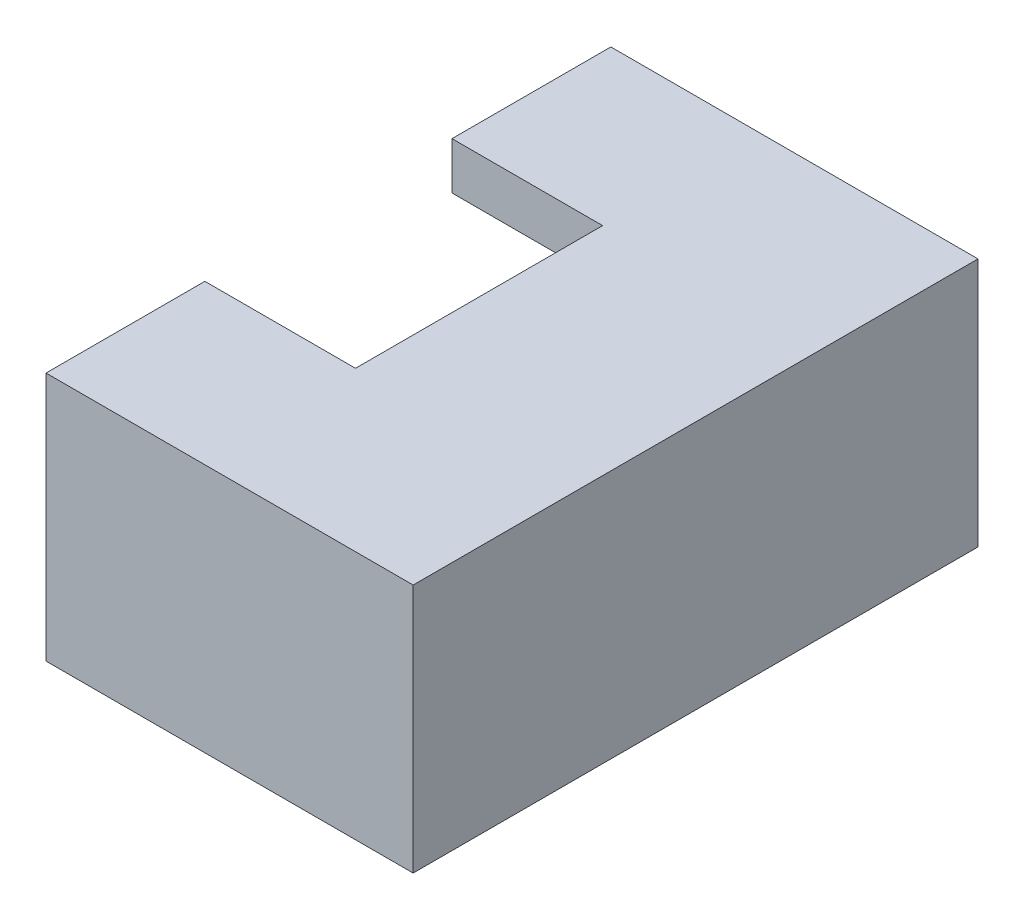
ISO-10303-21;
HEADER;
FILE_DESCRIPTION(('STEP AP214'),'2;1');
FILE_NAME('part.step','',(''),(''),'','','');
FILE_SCHEMA(('AUTOMOTIVE_DESIGN { 1 0 10303 214 1 1 1 1 }'));
ENDSEC;
DATA;
#1=APPLICATION_CONTEXT('core data for automotive mechanical design processes');
#2=APPLICATION_PROTOCOL_DEFINITION('international standard','automotive_design',2000,#1);
#3=PRODUCT_CONTEXT('',#1,'mechanical');
#4=PRODUCT('Part','Part','',(#3));
#5=PRODUCT_RELATED_PRODUCT_CATEGORY('part','',(#4));
#6=PRODUCT_DEFINITION_FORMATION('','',#4);
#7=PRODUCT_DEFINITION_CONTEXT('part definition',#1,'design');
#8=PRODUCT_DEFINITION('design','',#6,#7);
#9=PRODUCT_DEFINITION_SHAPE('','',#8);
#10=(LENGTH_UNIT() NAMED_UNIT(*) SI_UNIT(.MILLI.,.METRE.));
#11=(NAMED_UNIT(*) PLANE_ANGLE_UNIT() SI_UNIT($,.RADIAN.));
#12=(NAMED_UNIT(*) SI_UNIT($,.STERADIAN.) SOLID_ANGLE_UNIT());
#13=UNCERTAINTY_MEASURE_WITH_UNIT(LENGTH_MEASURE(1.E-05),#10,'distance_accuracy_value','');
#14=(GEOMETRIC_REPRESENTATION_CONTEXT(3) GLOBAL_UNCERTAINTY_ASSIGNED_CONTEXT((#13)) GLOBAL_UNIT_ASSIGNED_CONTEXT((#10,
#11,#12)) REPRESENTATION_CONTEXT('',''));
#15=CARTESIAN_POINT('',(0.,0.,0.));
#16=DIRECTION('',(0.,0.,1.));
#17=DIRECTION('',(1.,0.,0.));
#18=AXIS2_PLACEMENT_3D('',#15,#16,#17);
#19=CARTESIAN_POINT('',(3.55,3.4,-3.6));
#20=DIRECTION('',(0.,-1.,0.));
#21=DIRECTION('',(0.,0.,-1.));
#22=AXIS2_PLACEMENT_3D('',#19,#20,#21);
#23=PLANE('',#22);
#24=DIRECTION('',(1.,0.,0.));
#25=VECTOR('',#24,1.);
#26=CARTESIAN_POINT('',(3.55,3.4,-3.6));
#27=LINE('',#26,#25);
#28=CARTESIAN_POINT('',(7.55,3.4,-3.6));
#29=VERTEX_POINT('',#28);
#30=CARTESIAN_POINT('',(3.55,3.4,-3.6));
#31=VERTEX_POINT('',#30);
#32=EDGE_CURVE('P0_E64',#29,#31,#27,.F.);
#33=ORIENTED_EDGE('',*,*,#32,.T.);
#34=DIRECTION('',(0.,0.,1.));
#35=VECTOR('',#34,1.);
#36=CARTESIAN_POINT('',(3.55,3.4,0.));
#37=LINE('',#36,#35);
#38=CARTESIAN_POINT('',(3.55,3.4,-3.3));
#39=VERTEX_POINT('',#38);
#40=EDGE_CURVE('P0_E54',#39,#31,#37,.F.);
#41=ORIENTED_EDGE('',*,*,#40,.F.);
#42=DIRECTION('',(-1.,0.,0.));
#43=VECTOR('',#42,1.);
#44=CARTESIAN_POINT('',(3.55,3.4,-3.3));
#45=LINE('',#44,#43);
#46=CARTESIAN_POINT('',(7.55,3.4,-3.3));
#47=VERTEX_POINT('',#46);
#48=EDGE_CURVE('P0_E74',#39,#47,#45,.F.);
#49=ORIENTED_EDGE('',*,*,#48,.T.);
#50=DIRECTION('',(0.,0.,-1.));
#51=VECTOR('',#50,1.);
#52=CARTESIAN_POINT('',(7.55,3.4,-3.6));
#53=LINE('',#52,#51);
#54=EDGE_CURVE('P0_E19',#29,#47,#53,.F.);
#55=ORIENTED_EDGE('',*,*,#54,.F.);
#56=EDGE_LOOP('',(#33,#41,#49,#55));
#57=FACE_BOUND('',#56,.T.);
#58=ADVANCED_FACE('P0_F16',(#57),#23,.F.);
#59=CARTESIAN_POINT('',(3.55,3.4,-3.6));
#60=DIRECTION('',(0.,0.,1.));
#61=DIRECTION('',(1.,0.,0.));
#62=AXIS2_PLACEMENT_3D('',#59,#60,#61);
#63=PLANE('',#62);
#64=DIRECTION('',(1.,0.,0.));
#65=VECTOR('',#64,1.);
#66=CARTESIAN_POINT('',(3.55,3.1,-3.6));
#67=LINE('',#66,#65);
#68=CARTESIAN_POINT('',(7.55,3.1,-3.6));
#69=VERTEX_POINT('',#68);
#70=CARTESIAN_POINT('',(3.55,3.1,-3.6));
#71=VERTEX_POINT('',#70);
#72=EDGE_CURVE('P0_E72',#69,#71,#67,.F.);
#73=ORIENTED_EDGE('',*,*,#72,.T.);
#74=DIRECTION('',(0.,1.,0.));
#75=VECTOR('',#74,1.);
#76=CARTESIAN_POINT('',(3.55,0.,-3.6));
#77=LINE('',#76,#75);
#78=EDGE_CURVE('P0_E61',#31,#71,#77,.F.);
#79=ORIENTED_EDGE('',*,*,#78,.F.);
#80=ORIENTED_EDGE('',*,*,#32,.F.);
#81=DIRECTION('',(0.,1.,0.));
#82=VECTOR('',#81,1.);
#83=CARTESIAN_POINT('',(7.55,0.,-3.6));
#84=LINE('',#83,#82);
#85=EDGE_CURVE('P0_E78',#29,#69,#84,.F.);
#86=ORIENTED_EDGE('',*,*,#85,.T.);
#87=EDGE_LOOP('',(#73,#79,#80,#86));
#88=FACE_BOUND('',#87,.T.);
#89=ADVANCED_FACE('P0_F71',(#88),#63,.F.);
#90=CARTESIAN_POINT('',(3.55,0.,0.));
#91=DIRECTION('',(-1.,0.,0.));
#92=DIRECTION('',(0.,0.,1.));
#93=AXIS2_PLACEMENT_3D('',#90,#91,#92);
#94=PLANE('',#93);
#95=ORIENTED_EDGE('',*,*,#78,.T.);
#96=DIRECTION('',(0.,0.,1.));
#97=VECTOR('',#96,1.);
#98=CARTESIAN_POINT('',(3.55,3.1,-3.6));
#99=LINE('',#98,#97);
#100=CARTESIAN_POINT('',(3.55,3.1,-3.3));
#101=VERTEX_POINT('',#100);
#102=EDGE_CURVE('P0_E82',#71,#101,#99,.T.);
#103=ORIENTED_EDGE('',*,*,#102,.T.);
#104=DIRECTION('',(0.,1.,0.));
#105=VECTOR('',#104,1.);
#106=CARTESIAN_POINT('',(3.55,3.4,-3.3));
#107=LINE('',#106,#105);
#108=EDGE_CURVE('P0_E63',#101,#39,#107,.T.);
#109=ORIENTED_EDGE('',*,*,#108,.T.);
#110=ORIENTED_EDGE('',*,*,#40,.T.);
#111=EDGE_LOOP('',(#95,#103,#109,#110));
#112=FACE_BOUND('',#111,.T.);
#113=ADVANCED_FACE('P0_F58',(#112),#94,.T.);
#114=CARTESIAN_POINT('',(3.55,3.4,-3.3));
#115=DIRECTION('',(0.,0.,-1.));
#116=DIRECTION('',(-1.,0.,0.));
#117=AXIS2_PLACEMENT_3D('',#114,#115,#116);
#118=PLANE('',#117);
#119=ORIENTED_EDGE('',*,*,#48,.F.);
#120=ORIENTED_EDGE('',*,*,#108,.F.);
#121=DIRECTION('',(1.,0.,0.));
#122=VECTOR('',#121,1.);
#123=CARTESIAN_POINT('',(3.55,3.1,-3.3));
#124=LINE('',#123,#122);
#125=CARTESIAN_POINT('',(7.55,3.1,-3.3));
#126=VERTEX_POINT('',#125);
#127=EDGE_CURVE('P0_E25',#101,#126,#124,.T.);
#128=ORIENTED_EDGE('',*,*,#127,.T.);
#129=DIRECTION('',(0.,1.,0.));
#130=VECTOR('',#129,1.);
#131=CARTESIAN_POINT('',(7.55,0.,-3.3));
#132=LINE('',#131,#130);
#133=EDGE_CURVE('P0_E33',#126,#47,#132,.T.);
#134=ORIENTED_EDGE('',*,*,#133,.T.);
#135=EDGE_LOOP('',(#119,#120,#128,#134));
#136=FACE_BOUND('',#135,.T.);
#137=ADVANCED_FACE('P0_F87',(#136),#118,.F.);
#138=CARTESIAN_POINT('',(7.55,0.,0.));
#139=DIRECTION('',(-1.,0.,0.));
#140=DIRECTION('',(0.,0.,1.));
#141=AXIS2_PLACEMENT_3D('',#138,#139,#140);
#142=PLANE('',#141);
#143=DIRECTION('',(0.,0.,1.));
#144=VECTOR('',#143,1.);
#145=CARTESIAN_POINT('',(7.55,3.1,-3.6));
#146=LINE('',#145,#144);
#147=EDGE_CURVE('P0_E11',#126,#69,#146,.F.);
#148=ORIENTED_EDGE('',*,*,#147,.T.);
#149=ORIENTED_EDGE('',*,*,#85,.F.);
#150=ORIENTED_EDGE('',*,*,#54,.T.);
#151=ORIENTED_EDGE('',*,*,#133,.F.);
#152=EDGE_LOOP('',(#148,#149,#150,#151));
#153=FACE_BOUND('',#152,.T.);
#154=ADVANCED_FACE('P0_F90',(#153),#142,.F.);
#155=CARTESIAN_POINT('',(3.55,3.1,-3.6));
#156=DIRECTION('',(0.,1.,0.));
#157=DIRECTION('',(0.,0.,1.));
#158=AXIS2_PLACEMENT_3D('',#155,#156,#157);
#159=PLANE('',#158);
#160=ORIENTED_EDGE('',*,*,#127,.F.);
#161=ORIENTED_EDGE('',*,*,#102,.F.);
#162=ORIENTED_EDGE('',*,*,#72,.F.);
#163=ORIENTED_EDGE('',*,*,#147,.F.);
#164=EDGE_LOOP('',(#160,#161,#162,#163));
#165=FACE_BOUND('',#164,.T.);
#166=ADVANCED_FACE('P0_F89',(#165),#159,.F.);
#167=CLOSED_SHELL('',(#58,#89,#113,#137,#154,#166));
#168=MANIFOLD_SOLID_BREP('P0_B1',#167);
#169=CARTESIAN_POINT('',(3.55,3.4,-1.3));
#170=DIRECTION('',(0.,-1.,0.));
#171=DIRECTION('',(0.,0.,-1.));
#172=AXIS2_PLACEMENT_3D('',#169,#170,#171);
#173=PLANE('',#172);
#174=DIRECTION('',(1.,0.,0.));
#175=VECTOR('',#174,1.);
#176=CARTESIAN_POINT('',(3.55,3.4,-1.3));
#177=LINE('',#176,#175);
#178=CARTESIAN_POINT('',(7.55,3.4,-1.3));
#179=VERTEX_POINT('',#178);
#180=CARTESIAN_POINT('',(3.55,3.4,-1.3));
#181=VERTEX_POINT('',#180);
#182=EDGE_CURVE('P1_E64',#179,#181,#177,.F.);
#183=ORIENTED_EDGE('',*,*,#182,.T.);
#184=DIRECTION('',(0.,0.,1.));
#185=VECTOR('',#184,1.);
#186=CARTESIAN_POINT('',(3.55000000000001,3.4,0.));
#187=LINE('',#186,#185);
#188=CARTESIAN_POINT('',(3.55,3.4,-0.999999999999999));
#189=VERTEX_POINT('',#188);
#190=EDGE_CURVE('P1_E54',#189,#181,#187,.F.);
#191=ORIENTED_EDGE('',*,*,#190,.F.);
#192=DIRECTION('',(-1.,0.,0.));
#193=VECTOR('',#192,1.);
#194=CARTESIAN_POINT('',(3.55,3.4,-0.999999999999999));
#195=LINE('',#194,#193);
#196=CARTESIAN_POINT('',(7.55,3.4,-1.));
#197=VERTEX_POINT('',#196);
#198=EDGE_CURVE('P1_E74',#189,#197,#195,.F.);
#199=ORIENTED_EDGE('',*,*,#198,.T.);
#200=DIRECTION('',(0.,0.,-1.));
#201=VECTOR('',#200,1.);
#202=CARTESIAN_POINT('',(7.55,3.4,-1.3));
#203=LINE('',#202,#201);
#204=EDGE_CURVE('P1_E19',#179,#197,#203,.F.);
#205=ORIENTED_EDGE('',*,*,#204,.F.);
#206=EDGE_LOOP('',(#183,#191,#199,#205));
#207=FACE_BOUND('',#206,.T.);
#208=ADVANCED_FACE('P1_F16',(#207),#173,.F.);
#209=CARTESIAN_POINT('',(3.55,3.4,-1.3));
#210=DIRECTION('',(0.,0.,1.));
#211=DIRECTION('',(1.,0.,0.));
#212=AXIS2_PLACEMENT_3D('',#209,#210,#211);
#213=PLANE('',#212);
#214=DIRECTION('',(1.,0.,0.));
#215=VECTOR('',#214,1.);
#216=CARTESIAN_POINT('',(3.55,3.1,-1.3));
#217=LINE('',#216,#215);
#218=CARTESIAN_POINT('',(7.55,3.1,-1.3));
#219=VERTEX_POINT('',#218);
#220=CARTESIAN_POINT('',(3.55,3.1,-1.3));
#221=VERTEX_POINT('',#220);
#222=EDGE_CURVE('P1_E72',#219,#221,#217,.F.);
#223=ORIENTED_EDGE('',*,*,#222,.T.);
#224=DIRECTION('',(0.,1.,0.));
#225=VECTOR('',#224,1.);
#226=CARTESIAN_POINT('',(3.55,0.,-1.3));
#227=LINE('',#226,#225);
#228=EDGE_CURVE('P1_E61',#181,#221,#227,.F.);
#229=ORIENTED_EDGE('',*,*,#228,.F.);
#230=ORIENTED_EDGE('',*,*,#182,.F.);
#231=DIRECTION('',(0.,1.,0.));
#232=VECTOR('',#231,1.);
#233=CARTESIAN_POINT('',(7.55,0.,-1.3));
#234=LINE('',#233,#232);
#235=EDGE_CURVE('P1_E78',#179,#219,#234,.F.);
#236=ORIENTED_EDGE('',*,*,#235,.T.);
#237=EDGE_LOOP('',(#223,#229,#230,#236));
#238=FACE_BOUND('',#237,.T.);
#239=ADVANCED_FACE('P1_F71',(#238),#213,.F.);
#240=CARTESIAN_POINT('',(3.55000000000001,0.,0.));
#241=DIRECTION('',(-1.,0.,0.));
#242=DIRECTION('',(0.,0.,1.));
#243=AXIS2_PLACEMENT_3D('',#240,#241,#242);
#244=PLANE('',#243);
#245=ORIENTED_EDGE('',*,*,#228,.T.);
#246=DIRECTION('',(0.,0.,1.));
#247=VECTOR('',#246,1.);
#248=CARTESIAN_POINT('',(3.55,3.1,-1.3));
#249=LINE('',#248,#247);
#250=CARTESIAN_POINT('',(3.55,3.1,-0.999999999999999));
#251=VERTEX_POINT('',#250);
#252=EDGE_CURVE('P1_E82',#221,#251,#249,.T.);
#253=ORIENTED_EDGE('',*,*,#252,.T.);
#254=DIRECTION('',(0.,1.,0.));
#255=VECTOR('',#254,1.);
#256=CARTESIAN_POINT('',(3.55,3.4,-0.999999999999999));
#257=LINE('',#256,#255);
#258=EDGE_CURVE('P1_E63',#251,#189,#257,.T.);
#259=ORIENTED_EDGE('',*,*,#258,.T.);
#260=ORIENTED_EDGE('',*,*,#190,.T.);
#261=EDGE_LOOP('',(#245,#253,#259,#260));
#262=FACE_BOUND('',#261,.T.);
#263=ADVANCED_FACE('P1_F58',(#262),#244,.T.);
#264=CARTESIAN_POINT('',(3.55,3.4,-0.999999999999999));
#265=DIRECTION('',(0.,0.,-1.));
#266=DIRECTION('',(-1.,0.,0.));
#267=AXIS2_PLACEMENT_3D('',#264,#265,#266);
#268=PLANE('',#267);
#269=ORIENTED_EDGE('',*,*,#198,.F.);
#270=ORIENTED_EDGE('',*,*,#258,.F.);
#271=DIRECTION('',(1.,0.,0.));
#272=VECTOR('',#271,1.);
#273=CARTESIAN_POINT('',(3.55,3.1,-0.999999999999999));
#274=LINE('',#273,#272);
#275=CARTESIAN_POINT('',(7.55,3.1,-1.));
#276=VERTEX_POINT('',#275);
#277=EDGE_CURVE('P1_E25',#251,#276,#274,.T.);
#278=ORIENTED_EDGE('',*,*,#277,.T.);
#279=DIRECTION('',(0.,1.,0.));
#280=VECTOR('',#279,1.);
#281=CARTESIAN_POINT('',(7.55,0.,-1.));
#282=LINE('',#281,#280);
#283=EDGE_CURVE('P1_E33',#276,#197,#282,.T.);
#284=ORIENTED_EDGE('',*,*,#283,.T.);
#285=EDGE_LOOP('',(#269,#270,#278,#284));
#286=FACE_BOUND('',#285,.T.);
#287=ADVANCED_FACE('P1_F87',(#286),#268,.F.);
#288=CARTESIAN_POINT('',(7.55000000000001,0.,0.));
#289=DIRECTION('',(-1.,0.,0.));
#290=DIRECTION('',(0.,0.,1.));
#291=AXIS2_PLACEMENT_3D('',#288,#289,#290);
#292=PLANE('',#291);
#293=DIRECTION('',(0.,0.,1.));
#294=VECTOR('',#293,1.);
#295=CARTESIAN_POINT('',(7.55,3.1,-1.3));
#296=LINE('',#295,#294);
#297=EDGE_CURVE('P1_E11',#276,#219,#296,.F.);
#298=ORIENTED_EDGE('',*,*,#297,.T.);
#299=ORIENTED_EDGE('',*,*,#235,.F.);
#300=ORIENTED_EDGE('',*,*,#204,.T.);
#301=ORIENTED_EDGE('',*,*,#283,.F.);
#302=EDGE_LOOP('',(#298,#299,#300,#301));
#303=FACE_BOUND('',#302,.T.);
#304=ADVANCED_FACE('P1_F90',(#303),#292,.F.);
#305=CARTESIAN_POINT('',(3.55,3.1,-1.3));
#306=DIRECTION('',(0.,1.,0.));
#307=DIRECTION('',(0.,0.,1.));
#308=AXIS2_PLACEMENT_3D('',#305,#306,#307);
#309=PLANE('',#308);
#310=ORIENTED_EDGE('',*,*,#277,.F.);
#311=ORIENTED_EDGE('',*,*,#252,.F.);
#312=ORIENTED_EDGE('',*,*,#222,.F.);
#313=ORIENTED_EDGE('',*,*,#297,.F.);
#314=EDGE_LOOP('',(#310,#311,#312,#313));
#315=FACE_BOUND('',#314,.T.);
#316=ADVANCED_FACE('P1_F89',(#315),#309,.F.);
#317=CLOSED_SHELL('',(#208,#239,#263,#287,#304,#316));
#318=MANIFOLD_SOLID_BREP('P1_B1',#317);
#319=CARTESIAN_POINT('',(3.55,3.4,1.));
#320=DIRECTION('',(0.,-1.,0.));
#321=DIRECTION('',(0.,0.,-1.));
#322=AXIS2_PLACEMENT_3D('',#319,#320,#321);
#323=PLANE('',#322);
#324=DIRECTION('',(1.,0.,0.));
#325=VECTOR('',#324,1.);
#326=CARTESIAN_POINT('',(3.55,3.4,1.));
#327=LINE('',#326,#325);
#328=CARTESIAN_POINT('',(7.55,3.4,1.));
#329=VERTEX_POINT('',#328);
#330=CARTESIAN_POINT('',(3.55,3.4,1.));
#331=VERTEX_POINT('',#330);
#332=EDGE_CURVE('P2_E64',#329,#331,#327,.F.);
#333=ORIENTED_EDGE('',*,*,#332,.T.);
#334=DIRECTION('',(0.,0.,1.));
#335=VECTOR('',#334,1.);
#336=CARTESIAN_POINT('',(3.55,3.4,0.));
#337=LINE('',#336,#335);
#338=CARTESIAN_POINT('',(3.55,3.4,1.3));
#339=VERTEX_POINT('',#338);
#340=EDGE_CURVE('P2_E54',#339,#331,#337,.F.);
#341=ORIENTED_EDGE('',*,*,#340,.F.);
#342=DIRECTION('',(-1.,0.,0.));
#343=VECTOR('',#342,1.);
#344=CARTESIAN_POINT('',(3.55,3.4,1.3));
#345=LINE('',#344,#343);
#346=CARTESIAN_POINT('',(7.55,3.4,1.3));
#347=VERTEX_POINT('',#346);
#348=EDGE_CURVE('P2_E74',#339,#347,#345,.F.);
#349=ORIENTED_EDGE('',*,*,#348,.T.);
#350=DIRECTION('',(0.,0.,-1.));
#351=VECTOR('',#350,1.);
#352=CARTESIAN_POINT('',(7.55,3.4,1.));
#353=LINE('',#352,#351);
#354=EDGE_CURVE('P2_E19',#329,#347,#353,.F.);
#355=ORIENTED_EDGE('',*,*,#354,.F.);
#356=EDGE_LOOP('',(#333,#341,#349,#355));
#357=FACE_BOUND('',#356,.T.);
#358=ADVANCED_FACE('P2_F16',(#357),#323,.F.);
#359=CARTESIAN_POINT('',(3.55,3.4,1.));
#360=DIRECTION('',(0.,0.,1.));
#361=DIRECTION('',(1.,0.,0.));
#362=AXIS2_PLACEMENT_3D('',#359,#360,#361);
#363=PLANE('',#362);
#364=DIRECTION('',(1.,0.,0.));
#365=VECTOR('',#364,1.);
#366=CARTESIAN_POINT('',(3.55,3.1,0.999999999999999));
#367=LINE('',#366,#365);
#368=CARTESIAN_POINT('',(7.55,3.1,0.999999999999999));
#369=VERTEX_POINT('',#368);
#370=CARTESIAN_POINT('',(3.55,3.1,1.));
#371=VERTEX_POINT('',#370);
#372=EDGE_CURVE('P2_E72',#369,#371,#367,.F.);
#373=ORIENTED_EDGE('',*,*,#372,.T.);
#374=DIRECTION('',(0.,1.,0.));
#375=VECTOR('',#374,1.);
#376=CARTESIAN_POINT('',(3.55,0.,1.));
#377=LINE('',#376,#375);
#378=EDGE_CURVE('P2_E61',#331,#371,#377,.F.);
#379=ORIENTED_EDGE('',*,*,#378,.F.);
#380=ORIENTED_EDGE('',*,*,#332,.F.);
#381=DIRECTION('',(0.,1.,0.));
#382=VECTOR('',#381,1.);
#383=CARTESIAN_POINT('',(7.55,0.,0.999999999999999));
#384=LINE('',#383,#382);
#385=EDGE_CURVE('P2_E78',#329,#369,#384,.F.);
#386=ORIENTED_EDGE('',*,*,#385,.T.);
#387=EDGE_LOOP('',(#373,#379,#380,#386));
#388=FACE_BOUND('',#387,.T.);
#389=ADVANCED_FACE('P2_F71',(#388),#363,.F.);
#390=CARTESIAN_POINT('',(3.55,0.,0.));
#391=DIRECTION('',(-1.,0.,0.));
#392=DIRECTION('',(0.,0.,1.));
#393=AXIS2_PLACEMENT_3D('',#390,#391,#392);
#394=PLANE('',#393);
#395=ORIENTED_EDGE('',*,*,#378,.T.);
#396=DIRECTION('',(0.,0.,1.));
#397=VECTOR('',#396,1.);
#398=CARTESIAN_POINT('',(3.55,3.1,1.));
#399=LINE('',#398,#397);
#400=CARTESIAN_POINT('',(3.55,3.1,1.3));
#401=VERTEX_POINT('',#400);
#402=EDGE_CURVE('P2_E82',#371,#401,#399,.T.);
#403=ORIENTED_EDGE('',*,*,#402,.T.);
#404=DIRECTION('',(0.,1.,0.));
#405=VECTOR('',#404,1.);
#406=CARTESIAN_POINT('',(3.55,3.4,1.3));
#407=LINE('',#406,#405);
#408=EDGE_CURVE('P2_E63',#401,#339,#407,.T.);
#409=ORIENTED_EDGE('',*,*,#408,.T.);
#410=ORIENTED_EDGE('',*,*,#340,.T.);
#411=EDGE_LOOP('',(#395,#403,#409,#410));
#412=FACE_BOUND('',#411,.T.);
#413=ADVANCED_FACE('P2_F58',(#412),#394,.T.);
#414=CARTESIAN_POINT('',(3.55,3.4,1.3));
#415=DIRECTION('',(0.,0.,-1.));
#416=DIRECTION('',(-1.,0.,0.));
#417=AXIS2_PLACEMENT_3D('',#414,#415,#416);
#418=PLANE('',#417);
#419=ORIENTED_EDGE('',*,*,#348,.F.);
#420=ORIENTED_EDGE('',*,*,#408,.F.);
#421=DIRECTION('',(1.,0.,0.));
#422=VECTOR('',#421,1.);
#423=CARTESIAN_POINT('',(3.55,3.1,1.3));
#424=LINE('',#423,#422);
#425=CARTESIAN_POINT('',(7.55,3.1,1.3));
#426=VERTEX_POINT('',#425);
#427=EDGE_CURVE('P2_E25',#401,#426,#424,.T.);
#428=ORIENTED_EDGE('',*,*,#427,.T.);
#429=DIRECTION('',(0.,1.,0.));
#430=VECTOR('',#429,1.);
#431=CARTESIAN_POINT('',(7.55,0.,1.3));
#432=LINE('',#431,#430);
#433=EDGE_CURVE('P2_E33',#426,#347,#432,.T.);
#434=ORIENTED_EDGE('',*,*,#433,.T.);
#435=EDGE_LOOP('',(#419,#420,#428,#434));
#436=FACE_BOUND('',#435,.T.);
#437=ADVANCED_FACE('P2_F87',(#436),#418,.F.);
#438=CARTESIAN_POINT('',(7.55,0.,0.));
#439=DIRECTION('',(-1.,0.,0.));
#440=DIRECTION('',(0.,0.,1.));
#441=AXIS2_PLACEMENT_3D('',#438,#439,#440);
#442=PLANE('',#441);
#443=DIRECTION('',(0.,0.,1.));
#444=VECTOR('',#443,1.);
#445=CARTESIAN_POINT('',(7.55,3.1,1.));
#446=LINE('',#445,#444);
#447=EDGE_CURVE('P2_E11',#426,#369,#446,.F.);
#448=ORIENTED_EDGE('',*,*,#447,.T.);
#449=ORIENTED_EDGE('',*,*,#385,.F.);
#450=ORIENTED_EDGE('',*,*,#354,.T.);
#451=ORIENTED_EDGE('',*,*,#433,.F.);
#452=EDGE_LOOP('',(#448,#449,#450,#451));
#453=FACE_BOUND('',#452,.T.);
#454=ADVANCED_FACE('P2_F90',(#453),#442,.F.);
#455=CARTESIAN_POINT('',(3.55,3.1,1.));
#456=DIRECTION('',(0.,1.,0.));
#457=DIRECTION('',(0.,0.,1.));
#458=AXIS2_PLACEMENT_3D('',#455,#456,#457);
#459=PLANE('',#458);
#460=ORIENTED_EDGE('',*,*,#427,.F.);
#461=ORIENTED_EDGE('',*,*,#402,.F.);
#462=ORIENTED_EDGE('',*,*,#372,.F.);
#463=ORIENTED_EDGE('',*,*,#447,.F.);
#464=EDGE_LOOP('',(#460,#461,#462,#463));
#465=FACE_BOUND('',#464,.T.);
#466=ADVANCED_FACE('P2_F89',(#465),#459,.F.);
#467=CLOSED_SHELL('',(#358,#389,#413,#437,#454,#466));
#468=MANIFOLD_SOLID_BREP('P2_B1',#467);
#469=CARTESIAN_POINT('',(3.55000000000001,3.4,3.3));
#470=DIRECTION('',(0.,-1.,0.));
#471=DIRECTION('',(0.,0.,-1.));
#472=AXIS2_PLACEMENT_3D('',#469,#470,#471);
#473=PLANE('',#472);
#474=DIRECTION('',(1.,0.,0.));
#475=VECTOR('',#474,1.);
#476=CARTESIAN_POINT('',(3.55000000000001,3.4,3.3));
#477=LINE('',#476,#475);
#478=CARTESIAN_POINT('',(7.55,3.4,3.3));
#479=VERTEX_POINT('',#478);
#480=CARTESIAN_POINT('',(3.55000000000001,3.4,3.3));
#481=VERTEX_POINT('',#480);
#482=EDGE_CURVE('P3_E64',#479,#481,#477,.F.);
#483=ORIENTED_EDGE('',*,*,#482,.T.);
#484=DIRECTION('',(0.,0.,1.));
#485=VECTOR('',#484,1.);
#486=CARTESIAN_POINT('',(3.55000000000001,3.4,0.));
#487=LINE('',#486,#485);
#488=CARTESIAN_POINT('',(3.55000000000001,3.4,3.6));
#489=VERTEX_POINT('',#488);
#490=EDGE_CURVE('P3_E54',#489,#481,#487,.F.);
#491=ORIENTED_EDGE('',*,*,#490,.F.);
#492=DIRECTION('',(-1.,0.,0.));
#493=VECTOR('',#492,1.);
#494=CARTESIAN_POINT('',(3.55000000000001,3.4,3.6));
#495=LINE('',#494,#493);
#496=CARTESIAN_POINT('',(7.55,3.4,3.6));
#497=VERTEX_POINT('',#496);
#498=EDGE_CURVE('P3_E74',#489,#497,#495,.F.);
#499=ORIENTED_EDGE('',*,*,#498,.T.);
#500=DIRECTION('',(0.,0.,-1.));
#501=VECTOR('',#500,1.);
#502=CARTESIAN_POINT('',(7.55,3.4,3.3));
#503=LINE('',#502,#501);
#504=EDGE_CURVE('P3_E19',#479,#497,#503,.F.);
#505=ORIENTED_EDGE('',*,*,#504,.F.);
#506=EDGE_LOOP('',(#483,#491,#499,#505));
#507=FACE_BOUND('',#506,.T.);
#508=ADVANCED_FACE('P3_F16',(#507),#473,.F.);
#509=CARTESIAN_POINT('',(3.55000000000001,3.4,3.3));
#510=DIRECTION('',(0.,0.,1.));
#511=DIRECTION('',(1.,0.,0.));
#512=AXIS2_PLACEMENT_3D('',#509,#510,#511);
#513=PLANE('',#512);
#514=DIRECTION('',(1.,0.,0.));
#515=VECTOR('',#514,1.);
#516=CARTESIAN_POINT('',(3.55000000000001,3.1,3.3));
#517=LINE('',#516,#515);
#518=CARTESIAN_POINT('',(7.55,3.1,3.3));
#519=VERTEX_POINT('',#518);
#520=CARTESIAN_POINT('',(3.55000000000001,3.1,3.3));
#521=VERTEX_POINT('',#520);
#522=EDGE_CURVE('P3_E72',#519,#521,#517,.F.);
#523=ORIENTED_EDGE('',*,*,#522,.T.);
#524=DIRECTION('',(0.,1.,0.));
#525=VECTOR('',#524,1.);
#526=CARTESIAN_POINT('',(3.55000000000001,0.,3.3));
#527=LINE('',#526,#525);
#528=EDGE_CURVE('P3_E61',#481,#521,#527,.F.);
#529=ORIENTED_EDGE('',*,*,#528,.F.);
#530=ORIENTED_EDGE('',*,*,#482,.F.);
#531=DIRECTION('',(0.,1.,0.));
#532=VECTOR('',#531,1.);
#533=CARTESIAN_POINT('',(7.55,0.,3.3));
#534=LINE('',#533,#532);
#535=EDGE_CURVE('P3_E78',#479,#519,#534,.F.);
#536=ORIENTED_EDGE('',*,*,#535,.T.);
#537=EDGE_LOOP('',(#523,#529,#530,#536));
#538=FACE_BOUND('',#537,.T.);
#539=ADVANCED_FACE('P3_F71',(#538),#513,.F.);
#540=CARTESIAN_POINT('',(3.55000000000001,0.,0.));
#541=DIRECTION('',(-1.,0.,0.));
#542=DIRECTION('',(0.,0.,1.));
#543=AXIS2_PLACEMENT_3D('',#540,#541,#542);
#544=PLANE('',#543);
#545=ORIENTED_EDGE('',*,*,#528,.T.);
#546=DIRECTION('',(0.,0.,1.));
#547=VECTOR('',#546,1.);
#548=CARTESIAN_POINT('',(3.55000000000001,3.1,3.3));
#549=LINE('',#548,#547);
#550=CARTESIAN_POINT('',(3.55000000000001,3.1,3.6));
#551=VERTEX_POINT('',#550);
#552=EDGE_CURVE('P3_E82',#521,#551,#549,.T.);
#553=ORIENTED_EDGE('',*,*,#552,.T.);
#554=DIRECTION('',(0.,1.,0.));
#555=VECTOR('',#554,1.);
#556=CARTESIAN_POINT('',(3.55000000000001,3.4,3.6));
#557=LINE('',#556,#555);
#558=EDGE_CURVE('P3_E63',#551,#489,#557,.T.);
#559=ORIENTED_EDGE('',*,*,#558,.T.);
#560=ORIENTED_EDGE('',*,*,#490,.T.);
#561=EDGE_LOOP('',(#545,#553,#559,#560));
#562=FACE_BOUND('',#561,.T.);
#563=ADVANCED_FACE('P3_F58',(#562),#544,.T.);
#564=CARTESIAN_POINT('',(3.55000000000001,3.4,3.6));
#565=DIRECTION('',(0.,0.,-1.));
#566=DIRECTION('',(-1.,0.,0.));
#567=AXIS2_PLACEMENT_3D('',#564,#565,#566);
#568=PLANE('',#567);
#569=ORIENTED_EDGE('',*,*,#498,.F.);
#570=ORIENTED_EDGE('',*,*,#558,.F.);
#571=DIRECTION('',(1.,0.,0.));
#572=VECTOR('',#571,1.);
#573=CARTESIAN_POINT('',(3.55000000000001,3.1,3.6));
#574=LINE('',#573,#572);
#575=CARTESIAN_POINT('',(7.55,3.1,3.6));
#576=VERTEX_POINT('',#575);
#577=EDGE_CURVE('P3_E25',#551,#576,#574,.T.);
#578=ORIENTED_EDGE('',*,*,#577,.T.);
#579=DIRECTION('',(0.,1.,0.));
#580=VECTOR('',#579,1.);
#581=CARTESIAN_POINT('',(7.55,0.,3.6));
#582=LINE('',#581,#580);
#583=EDGE_CURVE('P3_E33',#576,#497,#582,.T.);
#584=ORIENTED_EDGE('',*,*,#583,.T.);
#585=EDGE_LOOP('',(#569,#570,#578,#584));
#586=FACE_BOUND('',#585,.T.);
#587=ADVANCED_FACE('P3_F87',(#586),#568,.F.);
#588=CARTESIAN_POINT('',(7.55,0.,0.));
#589=DIRECTION('',(-1.,0.,0.));
#590=DIRECTION('',(0.,0.,1.));
#591=AXIS2_PLACEMENT_3D('',#588,#589,#590);
#592=PLANE('',#591);
#593=DIRECTION('',(0.,0.,1.));
#594=VECTOR('',#593,1.);
#595=CARTESIAN_POINT('',(7.55,3.1,3.3));
#596=LINE('',#595,#594);
#597=EDGE_CURVE('P3_E11',#576,#519,#596,.F.);
#598=ORIENTED_EDGE('',*,*,#597,.T.);
#599=ORIENTED_EDGE('',*,*,#535,.F.);
#600=ORIENTED_EDGE('',*,*,#504,.T.);
#601=ORIENTED_EDGE('',*,*,#583,.F.);
#602=EDGE_LOOP('',(#598,#599,#600,#601));
#603=FACE_BOUND('',#602,.T.);
#604=ADVANCED_FACE('P3_F90',(#603),#592,.F.);
#605=CARTESIAN_POINT('',(3.55000000000001,3.1,3.3));
#606=DIRECTION('',(0.,1.,0.));
#607=DIRECTION('',(0.,0.,1.));
#608=AXIS2_PLACEMENT_3D('',#605,#606,#607);
#609=PLANE('',#608);
#610=ORIENTED_EDGE('',*,*,#577,.F.);
#611=ORIENTED_EDGE('',*,*,#552,.F.);
#612=ORIENTED_EDGE('',*,*,#522,.F.);
#613=ORIENTED_EDGE('',*,*,#597,.F.);
#614=EDGE_LOOP('',(#610,#611,#612,#613));
#615=FACE_BOUND('',#614,.T.);
#616=ADVANCED_FACE('P3_F89',(#615),#609,.F.);
#617=CLOSED_SHELL('',(#508,#539,#563,#587,#604,#616));
#618=MANIFOLD_SOLID_BREP('P3_B1',#617);
#619=CARTESIAN_POINT('',(7.55,5.55,-5.5));
#620=DIRECTION('',(0.,1.,0.));
#621=DIRECTION('',(0.,0.,1.));
#622=AXIS2_PLACEMENT_3D('',#619,#620,#621);
#623=PLANE('',#622);
#624=DIRECTION('',(-1.,0.,0.));
#625=VECTOR('',#624,1.);
#626=CARTESIAN_POINT('',(7.55,5.55,-5.5));
#627=LINE('',#626,#625);
#628=CARTESIAN_POINT('',(1.45,5.55,-5.5));
#629=VERTEX_POINT('',#628);
#630=CARTESIAN_POINT('',(7.55,5.55,-5.5));
#631=VERTEX_POINT('',#630);
#632=EDGE_CURVE('P4_E175',#629,#631,#627,.F.);
#633=ORIENTED_EDGE('',*,*,#632,.T.);
#634=DIRECTION('',(0.,0.,-1.));
#635=VECTOR('',#634,1.);
#636=CARTESIAN_POINT('',(7.55,5.55,0.));
#637=LINE('',#636,#635);
#638=CARTESIAN_POINT('',(7.55,5.55,-5.));
#639=VERTEX_POINT('',#638);
#640=EDGE_CURVE('P4_E150',#631,#639,#637,.F.);
#641=ORIENTED_EDGE('',*,*,#640,.T.);
#642=DIRECTION('',(1.,0.,0.));
#643=VECTOR('',#642,1.);
#644=CARTESIAN_POINT('',(7.55,5.55,-5.));
#645=LINE('',#644,#643);
#646=CARTESIAN_POINT('',(1.45,5.55,-5.));
#647=VERTEX_POINT('',#646);
#648=EDGE_CURVE('P4_E160',#639,#647,#645,.F.);
#649=ORIENTED_EDGE('',*,*,#648,.T.);
#650=DIRECTION('',(0.,0.,1.));
#651=VECTOR('',#650,1.);
#652=CARTESIAN_POINT('',(1.45,5.55,-5.5));
#653=LINE('',#652,#651);
#654=EDGE_CURVE('P4_E19',#629,#647,#653,.T.);
#655=ORIENTED_EDGE('',*,*,#654,.F.);
#656=EDGE_LOOP('',(#633,#641,#649,#655));
#657=FACE_BOUND('',#656,.T.);
#658=ADVANCED_FACE('P4_F16',(#657),#623,.F.);
#659=CARTESIAN_POINT('',(7.55,5.55,5.5));
#660=DIRECTION('',(0.,1.,0.));
#661=DIRECTION('',(0.,0.,1.));
#662=AXIS2_PLACEMENT_3D('',#659,#660,#661);
#663=PLANE('',#662);
#664=DIRECTION('',(-1.,0.,0.));
#665=VECTOR('',#664,1.);
#666=CARTESIAN_POINT('',(7.55,5.55,5.));
#667=LINE('',#666,#665);
#668=CARTESIAN_POINT('',(1.45,5.55,5.));
#669=VERTEX_POINT('',#668);
#670=CARTESIAN_POINT('',(7.55,5.55,5.));
#671=VERTEX_POINT('',#670);
#672=EDGE_CURVE('P4_E126',#669,#671,#667,.F.);
#673=ORIENTED_EDGE('',*,*,#672,.T.);
#674=DIRECTION('',(0.,0.,-1.));
#675=VECTOR('',#674,1.);
#676=CARTESIAN_POINT('',(7.55,5.55,0.));
#677=LINE('',#676,#675);
#678=CARTESIAN_POINT('',(7.55,5.55,5.5));
#679=VERTEX_POINT('',#678);
#680=EDGE_CURVE('P4_E155',#671,#679,#677,.F.);
#681=ORIENTED_EDGE('',*,*,#680,.T.);
#682=DIRECTION('',(1.,0.,0.));
#683=VECTOR('',#682,1.);
#684=CARTESIAN_POINT('',(7.55,5.55,5.5));
#685=LINE('',#684,#683);
#686=CARTESIAN_POINT('',(1.45,5.55,5.5));
#687=VERTEX_POINT('',#686);
#688=EDGE_CURVE('P4_E132',#679,#687,#685,.F.);
#689=ORIENTED_EDGE('',*,*,#688,.T.);
#690=DIRECTION('',(0.,0.,1.));
#691=VECTOR('',#690,1.);
#692=CARTESIAN_POINT('',(1.45,5.55,5.5));
#693=LINE('',#692,#691);
#694=EDGE_CURVE('P4_E129',#669,#687,#693,.T.);
#695=ORIENTED_EDGE('',*,*,#694,.F.);
#696=EDGE_LOOP('',(#673,#681,#689,#695));
#697=FACE_BOUND('',#696,.T.);
#698=ADVANCED_FACE('P4_F130',(#697),#663,.F.);
#699=CARTESIAN_POINT('',(7.55,5.55,5.));
#700=DIRECTION('',(0.,0.,-1.));
#701=DIRECTION('',(-1.,0.,0.));
#702=AXIS2_PLACEMENT_3D('',#699,#700,#701);
#703=PLANE('',#702);
#704=DIRECTION('',(1.,0.,0.));
#705=VECTOR('',#704,1.);
#706=CARTESIAN_POINT('',(7.55,5.05,5.));
#707=LINE('',#706,#705);
#708=CARTESIAN_POINT('',(1.45,5.05,5.));
#709=VERTEX_POINT('',#708);
#710=CARTESIAN_POINT('',(7.55,5.05,5.));
#711=VERTEX_POINT('',#710);
#712=EDGE_CURVE('P4_E201',#709,#711,#707,.T.);
#713=ORIENTED_EDGE('',*,*,#712,.T.);
#714=DIRECTION('',(0.,1.,0.));
#715=VECTOR('',#714,1.);
#716=CARTESIAN_POINT('',(7.55,0.,5.));
#717=LINE('',#716,#715);
#718=EDGE_CURVE('P4_E143',#711,#671,#717,.T.);
#719=ORIENTED_EDGE('',*,*,#718,.T.);
#720=ORIENTED_EDGE('',*,*,#672,.F.);
#721=DIRECTION('',(0.,1.,0.));
#722=VECTOR('',#721,1.);
#723=CARTESIAN_POINT('',(1.45,5.55,5.));
#724=LINE('',#723,#722);
#725=EDGE_CURVE('P4_E141',#709,#669,#724,.T.);
#726=ORIENTED_EDGE('',*,*,#725,.F.);
#727=EDGE_LOOP('',(#713,#719,#720,#726));
#728=FACE_BOUND('',#727,.T.);
#729=ADVANCED_FACE('P4_F140',(#728),#703,.F.);
#730=CARTESIAN_POINT('',(7.55,0.,0.));
#731=DIRECTION('',(1.,0.,0.));
#732=DIRECTION('',(0.,0.,-1.));
#733=AXIS2_PLACEMENT_3D('',#730,#731,#732);
#734=PLANE('',#733);
#735=DIRECTION('',(0.,0.,-1.));
#736=VECTOR('',#735,1.);
#737=CARTESIAN_POINT('',(7.55,1.25,-5.5));
#738=LINE('',#737,#736);
#739=CARTESIAN_POINT('',(7.55,1.25,-5.5));
#740=VERTEX_POINT('',#739);
#741=CARTESIAN_POINT('',(7.55,1.25,5.5));
#742=VERTEX_POINT('',#741);
#743=EDGE_CURVE('P4_E183',#740,#742,#738,.F.);
#744=ORIENTED_EDGE('',*,*,#743,.T.);
#745=DIRECTION('',(0.,1.,0.));
#746=VECTOR('',#745,1.);
#747=CARTESIAN_POINT('',(7.55,5.05,5.5));
#748=LINE('',#747,#746);
#749=EDGE_CURVE('P4_E188',#742,#679,#748,.T.);
#750=ORIENTED_EDGE('',*,*,#749,.T.);
#751=ORIENTED_EDGE('',*,*,#680,.F.);
#752=ORIENTED_EDGE('',*,*,#718,.F.);
#753=DIRECTION('',(0.,0.,1.));
#754=VECTOR('',#753,1.);
#755=CARTESIAN_POINT('',(7.55,5.05,-5.));
#756=LINE('',#755,#754);
#757=CARTESIAN_POINT('',(7.55,5.05,-5.));
#758=VERTEX_POINT('',#757);
#759=EDGE_CURVE('P4_E203',#711,#758,#756,.F.);
#760=ORIENTED_EDGE('',*,*,#759,.T.);
#761=DIRECTION('',(0.,1.,0.));
#762=VECTOR('',#761,1.);
#763=CARTESIAN_POINT('',(7.55,5.55,-5.));
#764=LINE('',#763,#762);
#765=EDGE_CURVE('P4_E157',#758,#639,#764,.T.);
#766=ORIENTED_EDGE('',*,*,#765,.T.);
#767=ORIENTED_EDGE('',*,*,#640,.F.);
#768=DIRECTION('',(0.,1.,0.));
#769=VECTOR('',#768,1.);
#770=CARTESIAN_POINT('',(7.55,5.05,-5.5));
#771=LINE('',#770,#769);
#772=EDGE_CURVE('P4_E178',#631,#740,#771,.F.);
#773=ORIENTED_EDGE('',*,*,#772,.T.);
#774=EDGE_LOOP('',(#744,#750,#751,#752,#760,#766,#767,#773));
#775=FACE_BOUND('',#774,.T.);
#776=ADVANCED_FACE('P4_F319',(#775),#734,.F.);
#777=CARTESIAN_POINT('',(7.55,5.55,-5.));
#778=DIRECTION('',(0.,0.,1.));
#779=DIRECTION('',(1.,0.,0.));
#780=AXIS2_PLACEMENT_3D('',#777,#778,#779);
#781=PLANE('',#780);
#782=ORIENTED_EDGE('',*,*,#648,.F.);
#783=ORIENTED_EDGE('',*,*,#765,.F.);
#784=DIRECTION('',(1.,0.,0.));
#785=VECTOR('',#784,1.);
#786=CARTESIAN_POINT('',(7.55,5.05,-5.));
#787=LINE('',#786,#785);
#788=CARTESIAN_POINT('',(1.45,5.05,-5.));
#789=VERTEX_POINT('',#788);
#790=EDGE_CURVE('P4_E206',#758,#789,#787,.F.);
#791=ORIENTED_EDGE('',*,*,#790,.T.);
#792=DIRECTION('',(0.,1.,0.));
#793=VECTOR('',#792,1.);
#794=CARTESIAN_POINT('',(1.45,5.55,-5.));
#795=LINE('',#794,#793);
#796=EDGE_CURVE('P4_E163',#647,#789,#795,.F.);
#797=ORIENTED_EDGE('',*,*,#796,.F.);
#798=EDGE_LOOP('',(#782,#783,#791,#797));
#799=FACE_BOUND('',#798,.T.);
#800=ADVANCED_FACE('P4_F315',(#799),#781,.F.);
#801=CARTESIAN_POINT('',(1.45,1.75,-2.625));
#802=DIRECTION('',(0.,0.,-1.));
#803=DIRECTION('',(-1.,0.,0.));
#804=AXIS2_PLACEMENT_3D('',#801,#802,#803);
#805=PLANE('',#804);
#806=DIRECTION('',(1.,0.,0.));
#807=VECTOR('',#806,1.);
#808=CARTESIAN_POINT('',(7.55,5.05,-2.625));
#809=LINE('',#808,#807);
#810=CARTESIAN_POINT('',(1.45,5.05,-2.625));
#811=VERTEX_POINT('',#810);
#812=CARTESIAN_POINT('',(4.65,5.05,-2.625));
#813=VERTEX_POINT('',#812);
#814=EDGE_CURVE('P4_E192',#811,#813,#809,.T.);
#815=ORIENTED_EDGE('',*,*,#814,.T.);
#816=DIRECTION('',(0.,1.,0.));
#817=VECTOR('',#816,1.);
#818=CARTESIAN_POINT('',(4.65,1.75,-2.625));
#819=LINE('',#818,#817);
#820=CARTESIAN_POINT('',(4.65,6.05,-2.625));
#821=VERTEX_POINT('',#820);
#822=EDGE_CURVE('P4_E167',#813,#821,#819,.T.);
#823=ORIENTED_EDGE('',*,*,#822,.T.);
#824=DIRECTION('',(1.,0.,0.));
#825=VECTOR('',#824,1.);
#826=CARTESIAN_POINT('',(0.,6.05,-2.625));
#827=LINE('',#826,#825);
#828=CARTESIAN_POINT('',(1.45,6.05,-2.625));
#829=VERTEX_POINT('',#828);
#830=EDGE_CURVE('P4_E209',#829,#821,#827,.T.);
#831=ORIENTED_EDGE('',*,*,#830,.F.);
#832=DIRECTION('',(0.,1.,0.));
#833=VECTOR('',#832,1.);
#834=CARTESIAN_POINT('',(1.45,1.75,-2.625));
#835=LINE('',#834,#833);
#836=EDGE_CURVE('P4_E165',#811,#829,#835,.T.);
#837=ORIENTED_EDGE('',*,*,#836,.F.);
#838=EDGE_LOOP('',(#815,#823,#831,#837));
#839=FACE_BOUND('',#838,.T.);
#840=ADVANCED_FACE('P4_F311',(#839),#805,.F.);
#841=CARTESIAN_POINT('',(4.65,1.75,-2.625));
#842=DIRECTION('',(1.,0.,0.));
#843=DIRECTION('',(0.,0.,-1.));
#844=AXIS2_PLACEMENT_3D('',#841,#842,#843);
#845=PLANE('',#844);
#846=DIRECTION('',(0.,0.,1.));
#847=VECTOR('',#846,1.);
#848=CARTESIAN_POINT('',(4.65,5.05,-5.));
#849=LINE('',#848,#847);
#850=CARTESIAN_POINT('',(4.65,5.05,2.625));
#851=VERTEX_POINT('',#850);
#852=EDGE_CURVE('P4_E195',#813,#851,#849,.T.);
#853=ORIENTED_EDGE('',*,*,#852,.T.);
#854=DIRECTION('',(0.,1.,0.));
#855=VECTOR('',#854,1.);
#856=CARTESIAN_POINT('',(4.65,1.75,2.625));
#857=LINE('',#856,#855);
#858=CARTESIAN_POINT('',(4.65,6.05,2.625));
#859=VERTEX_POINT('',#858);
#860=EDGE_CURVE('P4_E172',#851,#859,#857,.T.);
#861=ORIENTED_EDGE('',*,*,#860,.T.);
#862=DIRECTION('',(0.,0.,1.));
#863=VECTOR('',#862,1.);
#864=CARTESIAN_POINT('',(4.65,6.05,0.));
#865=LINE('',#864,#863);
#866=EDGE_CURVE('P4_E211',#821,#859,#865,.T.);
#867=ORIENTED_EDGE('',*,*,#866,.F.);
#868=ORIENTED_EDGE('',*,*,#822,.F.);
#869=EDGE_LOOP('',(#853,#861,#867,#868));
#870=FACE_BOUND('',#869,.T.);
#871=ADVANCED_FACE('P4_F307',(#870),#845,.F.);
#872=CARTESIAN_POINT('',(1.45,1.75,2.625));
#873=DIRECTION('',(0.,0.,1.));
#874=DIRECTION('',(1.,0.,0.));
#875=AXIS2_PLACEMENT_3D('',#872,#873,#874);
#876=PLANE('',#875);
#877=DIRECTION('',(1.,0.,0.));
#878=VECTOR('',#877,1.);
#879=CARTESIAN_POINT('',(7.55,5.05,2.625));
#880=LINE('',#879,#878);
#881=CARTESIAN_POINT('',(1.45,5.05,2.625));
#882=VERTEX_POINT('',#881);
#883=EDGE_CURVE('P4_E198',#851,#882,#880,.F.);
#884=ORIENTED_EDGE('',*,*,#883,.T.);
#885=DIRECTION('',(0.,1.,0.));
#886=VECTOR('',#885,1.);
#887=CARTESIAN_POINT('',(1.45,1.75,2.625));
#888=LINE('',#887,#886);
#889=CARTESIAN_POINT('',(1.45,6.05,2.625));
#890=VERTEX_POINT('',#889);
#891=EDGE_CURVE('P4_E170',#890,#882,#888,.F.);
#892=ORIENTED_EDGE('',*,*,#891,.F.);
#893=DIRECTION('',(1.,0.,0.));
#894=VECTOR('',#893,1.);
#895=CARTESIAN_POINT('',(0.,6.05,2.625));
#896=LINE('',#895,#894);
#897=EDGE_CURVE('P4_E213',#859,#890,#896,.F.);
#898=ORIENTED_EDGE('',*,*,#897,.F.);
#899=ORIENTED_EDGE('',*,*,#860,.F.);
#900=EDGE_LOOP('',(#884,#892,#898,#899));
#901=FACE_BOUND('',#900,.T.);
#902=ADVANCED_FACE('P4_F303',(#901),#876,.F.);
#903=CARTESIAN_POINT('',(7.55,5.05,-5.5));
#904=DIRECTION('',(0.,0.,-1.));
#905=DIRECTION('',(-1.,0.,0.));
#906=AXIS2_PLACEMENT_3D('',#903,#904,#905);
#907=PLANE('',#906);
#908=DIRECTION('',(1.,0.,0.));
#909=VECTOR('',#908,1.);
#910=CARTESIAN_POINT('',(7.55,1.25,-5.5));
#911=LINE('',#910,#909);
#912=CARTESIAN_POINT('',(1.45,1.25,-5.5));
#913=VERTEX_POINT('',#912);
#914=EDGE_CURVE('P4_E180',#913,#740,#911,.T.);
#915=ORIENTED_EDGE('',*,*,#914,.T.);
#916=ORIENTED_EDGE('',*,*,#772,.F.);
#917=ORIENTED_EDGE('',*,*,#632,.F.);
#918=DIRECTION('',(0.,1.,0.));
#919=VECTOR('',#918,1.);
#920=CARTESIAN_POINT('',(1.45,6.05,-5.5));
#921=LINE('',#920,#919);
#922=EDGE_CURVE('P4_E218',#629,#913,#921,.F.);
#923=ORIENTED_EDGE('',*,*,#922,.T.);
#924=EDGE_LOOP('',(#915,#916,#917,#923));
#925=FACE_BOUND('',#924,.T.);
#926=ADVANCED_FACE('P4_F299',(#925),#907,.F.);
#927=CARTESIAN_POINT('',(7.55,1.25,-5.5));
#928=DIRECTION('',(0.,-1.,0.));
#929=DIRECTION('',(0.,0.,-1.));
#930=AXIS2_PLACEMENT_3D('',#927,#928,#929);
#931=PLANE('',#930);
#932=DIRECTION('',(1.,0.,0.));
#933=VECTOR('',#932,1.);
#934=CARTESIAN_POINT('',(7.55,1.25,5.5));
#935=LINE('',#934,#933);
#936=CARTESIAN_POINT('',(1.45,1.25,5.5));
#937=VERTEX_POINT('',#936);
#938=EDGE_CURVE('P4_E185',#937,#742,#935,.T.);
#939=ORIENTED_EDGE('',*,*,#938,.T.);
#940=ORIENTED_EDGE('',*,*,#743,.F.);
#941=ORIENTED_EDGE('',*,*,#914,.F.);
#942=DIRECTION('',(0.,0.,-1.));
#943=VECTOR('',#942,1.);
#944=CARTESIAN_POINT('',(1.45,1.25,-6.));
#945=LINE('',#944,#943);
#946=EDGE_CURVE('P4_E221',#913,#937,#945,.F.);
#947=ORIENTED_EDGE('',*,*,#946,.T.);
#948=EDGE_LOOP('',(#939,#940,#941,#947));
#949=FACE_BOUND('',#948,.T.);
#950=ADVANCED_FACE('P4_F295',(#949),#931,.F.);
#951=CARTESIAN_POINT('',(7.55,5.05,5.5));
#952=DIRECTION('',(0.,0.,1.));
#953=DIRECTION('',(1.,0.,0.));
#954=AXIS2_PLACEMENT_3D('',#951,#952,#953);
#955=PLANE('',#954);
#956=ORIENTED_EDGE('',*,*,#688,.F.);
#957=ORIENTED_EDGE('',*,*,#749,.F.);
#958=ORIENTED_EDGE('',*,*,#938,.F.);
#959=DIRECTION('',(0.,1.,0.));
#960=VECTOR('',#959,1.);
#961=CARTESIAN_POINT('',(1.45,6.05,5.5));
#962=LINE('',#961,#960);
#963=EDGE_CURVE('P4_E224',#937,#687,#962,.T.);
#964=ORIENTED_EDGE('',*,*,#963,.T.);
#965=EDGE_LOOP('',(#956,#957,#958,#964));
#966=FACE_BOUND('',#965,.T.);
#967=ADVANCED_FACE('P4_F291',(#966),#955,.F.);
#968=CARTESIAN_POINT('',(7.55,5.05,-5.));
#969=DIRECTION('',(0.,1.,0.));
#970=DIRECTION('',(0.,0.,1.));
#971=AXIS2_PLACEMENT_3D('',#968,#969,#970);
#972=PLANE('',#971);
#973=ORIENTED_EDGE('',*,*,#790,.F.);
#974=ORIENTED_EDGE('',*,*,#759,.F.);
#975=ORIENTED_EDGE('',*,*,#712,.F.);
#976=DIRECTION('',(0.,0.,-1.));
#977=VECTOR('',#976,1.);
#978=CARTESIAN_POINT('',(1.45,5.05,-6.));
#979=LINE('',#978,#977);
#980=EDGE_CURVE('P4_E149',#709,#882,#979,.T.);
#981=ORIENTED_EDGE('',*,*,#980,.T.);
#982=ORIENTED_EDGE('',*,*,#883,.F.);
#983=ORIENTED_EDGE('',*,*,#852,.F.);
#984=ORIENTED_EDGE('',*,*,#814,.F.);
#985=DIRECTION('',(0.,0.,-1.));
#986=VECTOR('',#985,1.);
#987=CARTESIAN_POINT('',(1.45,5.05,-6.));
#988=LINE('',#987,#986);
#989=EDGE_CURVE('P4_E235',#811,#789,#988,.T.);
#990=ORIENTED_EDGE('',*,*,#989,.T.);
#991=EDGE_LOOP('',(#973,#974,#975,#981,#982,#983,#984,#990));
#992=FACE_BOUND('',#991,.T.);
#993=ADVANCED_FACE('P4_F287',(#992),#972,.F.);
#994=CARTESIAN_POINT('',(0.,6.05,0.));
#995=DIRECTION('',(0.,1.,0.));
#996=DIRECTION('',(0.,0.,1.));
#997=AXIS2_PLACEMENT_3D('',#994,#995,#996);
#998=PLANE('',#997);
#999=DIRECTION('',(1.,0.,0.));
#1000=VECTOR('',#999,1.);
#1001=CARTESIAN_POINT('',(1.45,6.05,-6.));
#1002=LINE('',#1001,#1000);
#1003=CARTESIAN_POINT('',(9.25,6.05,-6.));
#1004=VERTEX_POINT('',#1003);
#1005=CARTESIAN_POINT('',(1.45,6.05,-6.));
#1006=VERTEX_POINT('',#1005);
#1007=EDGE_CURVE('P4_E216',#1004,#1006,#1002,.F.);
#1008=ORIENTED_EDGE('',*,*,#1007,.T.);
#1009=DIRECTION('',(0.,0.,-1.));
#1010=VECTOR('',#1009,1.);
#1011=CARTESIAN_POINT('',(1.45,6.05,-6.));
#1012=LINE('',#1011,#1010);
#1013=EDGE_CURVE('P4_E232',#1006,#829,#1012,.F.);
#1014=ORIENTED_EDGE('',*,*,#1013,.T.);
#1015=ORIENTED_EDGE('',*,*,#830,.T.);
#1016=ORIENTED_EDGE('',*,*,#866,.T.);
#1017=ORIENTED_EDGE('',*,*,#897,.T.);
#1018=DIRECTION('',(0.,0.,-1.));
#1019=VECTOR('',#1018,1.);
#1020=CARTESIAN_POINT('',(1.45,6.05,-6.));
#1021=LINE('',#1020,#1019);
#1022=CARTESIAN_POINT('',(1.45,6.05,6.));
#1023=VERTEX_POINT('',#1022);
#1024=EDGE_CURVE('P4_E227',#890,#1023,#1021,.F.);
#1025=ORIENTED_EDGE('',*,*,#1024,.T.);
#1026=DIRECTION('',(-1.,0.,0.));
#1027=VECTOR('',#1026,1.);
#1028=CARTESIAN_POINT('',(1.45,6.05,6.));
#1029=LINE('',#1028,#1027);
#1030=CARTESIAN_POINT('',(9.25,6.05,6.));
#1031=VERTEX_POINT('',#1030);
#1032=EDGE_CURVE('P4_E241',#1023,#1031,#1029,.F.);
#1033=ORIENTED_EDGE('',*,*,#1032,.T.);
#1034=DIRECTION('',(0.,0.,1.));
#1035=VECTOR('',#1034,1.);
#1036=CARTESIAN_POINT('',(9.25,6.05,-6.));
#1037=LINE('',#1036,#1035);
#1038=EDGE_CURVE('P4_E244',#1031,#1004,#1037,.F.);
#1039=ORIENTED_EDGE('',*,*,#1038,.T.);
#1040=EDGE_LOOP('',(#1008,#1014,#1015,#1016,#1017,#1025,#1033,#1039));
#1041=FACE_BOUND('',#1040,.T.);
#1042=ADVANCED_FACE('P4_F284',(#1041),#998,.T.);
#1043=CARTESIAN_POINT('',(1.45,6.05,-6.));
#1044=DIRECTION('',(0.,0.,1.));
#1045=DIRECTION('',(1.,0.,0.));
#1046=AXIS2_PLACEMENT_3D('',#1043,#1044,#1045);
#1047=PLANE('',#1046);
#1048=DIRECTION('',(0.,1.,0.));
#1049=VECTOR('',#1048,1.);
#1050=CARTESIAN_POINT('',(1.45,6.05,-6.));
#1051=LINE('',#1050,#1049);
#1052=CARTESIAN_POINT('',(1.45,0.75,-6.));
#1053=VERTEX_POINT('',#1052);
#1054=EDGE_CURVE('P4_E229',#1053,#1006,#1051,.T.);
#1055=ORIENTED_EDGE('',*,*,#1054,.T.);
#1056=ORIENTED_EDGE('',*,*,#1007,.F.);
#1057=DIRECTION('',(0.,1.,0.));
#1058=VECTOR('',#1057,1.);
#1059=CARTESIAN_POINT('',(9.25,6.05,-6.));
#1060=LINE('',#1059,#1058);
#1061=CARTESIAN_POINT('',(9.25,0.75,-6.));
#1062=VERTEX_POINT('',#1061);
#1063=EDGE_CURVE('P4_E247',#1004,#1062,#1060,.F.);
#1064=ORIENTED_EDGE('',*,*,#1063,.T.);
#1065=DIRECTION('',(1.,0.,0.));
#1066=VECTOR('',#1065,1.);
#1067=CARTESIAN_POINT('',(0.,0.75,-6.));
#1068=LINE('',#1067,#1066);
#1069=EDGE_CURVE('P4_E250',#1062,#1053,#1068,.F.);
#1070=ORIENTED_EDGE('',*,*,#1069,.T.);
#1071=EDGE_LOOP('',(#1055,#1056,#1064,#1070));
#1072=FACE_BOUND('',#1071,.T.);
#1073=ADVANCED_FACE('P4_F267',(#1072),#1047,.F.);
#1074=CARTESIAN_POINT('',(1.45,6.05,-6.));
#1075=DIRECTION('',(1.,0.,0.));
#1076=DIRECTION('',(0.,0.,-1.));
#1077=AXIS2_PLACEMENT_3D('',#1074,#1075,#1076);
#1078=PLANE('',#1077);
#1079=ORIENTED_EDGE('',*,*,#989,.F.);
#1080=ORIENTED_EDGE('',*,*,#836,.T.);
#1081=ORIENTED_EDGE('',*,*,#1013,.F.);
#1082=ORIENTED_EDGE('',*,*,#1054,.F.);
#1083=DIRECTION('',(0.,0.,1.));
#1084=VECTOR('',#1083,1.);
#1085=CARTESIAN_POINT('',(1.45,0.75,0.));
#1086=LINE('',#1085,#1084);
#1087=CARTESIAN_POINT('',(1.45,0.75,6.));
#1088=VERTEX_POINT('',#1087);
#1089=EDGE_CURVE('P4_E253',#1053,#1088,#1086,.T.);
#1090=ORIENTED_EDGE('',*,*,#1089,.T.);
#1091=DIRECTION('',(0.,1.,0.));
#1092=VECTOR('',#1091,1.);
#1093=CARTESIAN_POINT('',(1.45,6.05,6.));
#1094=LINE('',#1093,#1092);
#1095=EDGE_CURVE('P4_E238',#1088,#1023,#1094,.T.);
#1096=ORIENTED_EDGE('',*,*,#1095,.T.);
#1097=ORIENTED_EDGE('',*,*,#1024,.F.);
#1098=ORIENTED_EDGE('',*,*,#891,.T.);
#1099=ORIENTED_EDGE('',*,*,#980,.F.);
#1100=ORIENTED_EDGE('',*,*,#725,.T.);
#1101=ORIENTED_EDGE('',*,*,#694,.T.);
#1102=ORIENTED_EDGE('',*,*,#963,.F.);
#1103=ORIENTED_EDGE('',*,*,#946,.F.);
#1104=ORIENTED_EDGE('',*,*,#922,.F.);
#1105=ORIENTED_EDGE('',*,*,#654,.T.);
#1106=ORIENTED_EDGE('',*,*,#796,.T.);
#1107=EDGE_LOOP('',(#1079,#1080,#1081,#1082,#1090,#1096,#1097,#1098,#1099,#1100,#1101,#1102,
#1103,#1104,#1105,#1106));
#1108=FACE_BOUND('',#1107,.T.);
#1109=ADVANCED_FACE('P4_F147',(#1108),#1078,.F.);
#1110=CARTESIAN_POINT('',(1.45,6.05,6.));
#1111=DIRECTION('',(0.,0.,-1.));
#1112=DIRECTION('',(-1.,0.,0.));
#1113=AXIS2_PLACEMENT_3D('',#1110,#1111,#1112);
#1114=PLANE('',#1113);
#1115=DIRECTION('',(0.,1.,0.));
#1116=VECTOR('',#1115,1.);
#1117=CARTESIAN_POINT('',(9.25,6.05,6.));
#1118=LINE('',#1117,#1116);
#1119=CARTESIAN_POINT('',(9.25,0.75,6.));
#1120=VERTEX_POINT('',#1119);
#1121=EDGE_CURVE('P4_E33',#1120,#1031,#1118,.T.);
#1122=ORIENTED_EDGE('',*,*,#1121,.T.);
#1123=ORIENTED_EDGE('',*,*,#1032,.F.);
#1124=ORIENTED_EDGE('',*,*,#1095,.F.);
#1125=DIRECTION('',(1.,0.,0.));
#1126=VECTOR('',#1125,1.);
#1127=CARTESIAN_POINT('',(0.,0.75,6.));
#1128=LINE('',#1127,#1126);
#1129=EDGE_CURVE('P4_E25',#1088,#1120,#1128,.T.);
#1130=ORIENTED_EDGE('',*,*,#1129,.T.);
#1131=EDGE_LOOP('',(#1122,#1123,#1124,#1130));
#1132=FACE_BOUND('',#1131,.T.);
#1133=ADVANCED_FACE('P4_F259',(#1132),#1114,.F.);
#1134=CARTESIAN_POINT('',(9.25,6.05,-6.));
#1135=DIRECTION('',(-1.,0.,0.));
#1136=DIRECTION('',(0.,0.,1.));
#1137=AXIS2_PLACEMENT_3D('',#1134,#1135,#1136);
#1138=PLANE('',#1137);
#1139=ORIENTED_EDGE('',*,*,#1063,.F.);
#1140=ORIENTED_EDGE('',*,*,#1038,.F.);
#1141=ORIENTED_EDGE('',*,*,#1121,.F.);
#1142=DIRECTION('',(0.,0.,1.));
#1143=VECTOR('',#1142,1.);
#1144=CARTESIAN_POINT('',(9.25,0.75,0.));
#1145=LINE('',#1144,#1143);
#1146=EDGE_CURVE('P4_E11',#1120,#1062,#1145,.F.);
#1147=ORIENTED_EDGE('',*,*,#1146,.T.);
#1148=EDGE_LOOP('',(#1139,#1140,#1141,#1147));
#1149=FACE_BOUND('',#1148,.T.);
#1150=ADVANCED_FACE('P4_F269',(#1149),#1138,.F.);
#1151=CARTESIAN_POINT('',(0.,0.75,0.));
#1152=DIRECTION('',(0.,1.,0.));
#1153=DIRECTION('',(0.,0.,1.));
#1154=AXIS2_PLACEMENT_3D('',#1151,#1152,#1153);
#1155=PLANE('',#1154);
#1156=ORIENTED_EDGE('',*,*,#1129,.F.);
#1157=ORIENTED_EDGE('',*,*,#1089,.F.);
#1158=ORIENTED_EDGE('',*,*,#1069,.F.);
#1159=ORIENTED_EDGE('',*,*,#1146,.F.);
#1160=EDGE_LOOP('',(#1156,#1157,#1158,#1159));
#1161=FACE_BOUND('',#1160,.T.);
#1162=ADVANCED_FACE('P4_F263',(#1161),#1155,.F.);
#1163=CLOSED_SHELL('',(#658,#698,#729,#776,#800,#840,#871,#902,#926,#950,#967,#993,#1042,#1073,
#1109,#1133,#1150,#1162));
#1164=MANIFOLD_SOLID_BREP('P4_B1',#1163);
#1165=ADVANCED_BREP_SHAPE_REPRESENTATION('',(#18,#168,#318,#468,#618,#1164),#14);
#1166=SHAPE_DEFINITION_REPRESENTATION(#9,#1165);
ENDSEC;
END-ISO-10303-21;
